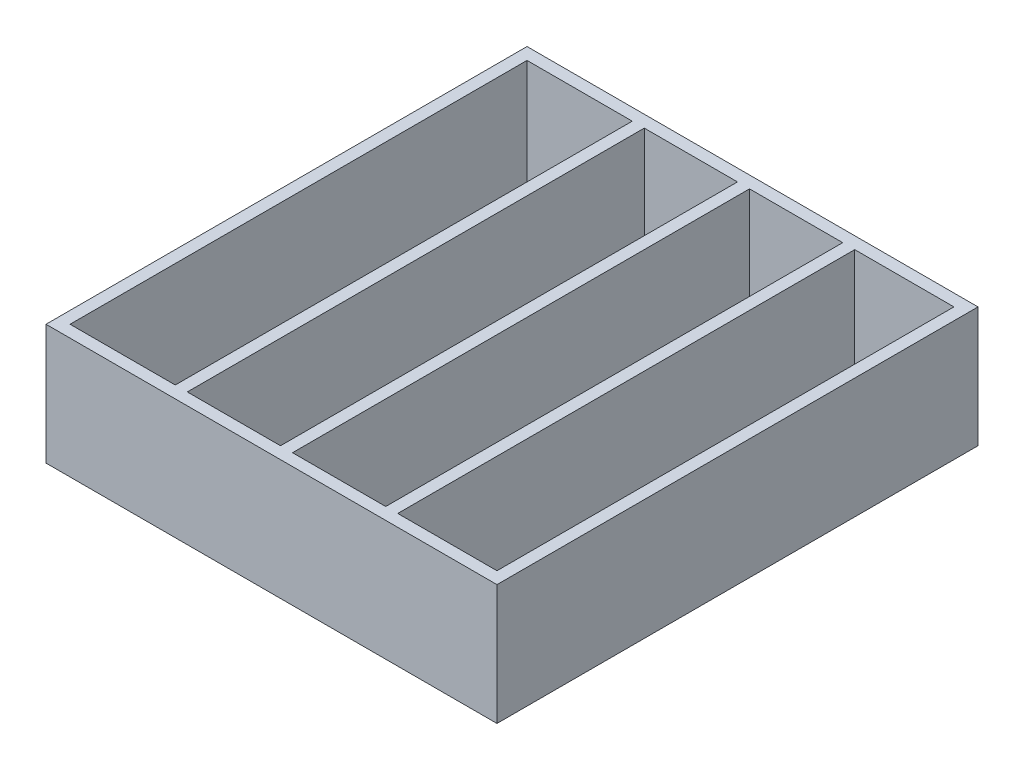
ISO-10303-21;
HEADER;
FILE_DESCRIPTION(('STEP AP214'),'2;1');
FILE_NAME('part.step','',(''),(''),'','','');
FILE_SCHEMA(('AUTOMOTIVE_DESIGN { 1 0 10303 214 1 1 1 1 }'));
ENDSEC;
DATA;
#1=APPLICATION_CONTEXT('core data for automotive mechanical design processes');
#2=APPLICATION_PROTOCOL_DEFINITION('international standard','automotive_design',2000,#1);
#3=PRODUCT_CONTEXT('',#1,'mechanical');
#4=PRODUCT('Part','Part','',(#3));
#5=PRODUCT_RELATED_PRODUCT_CATEGORY('part','',(#4));
#6=PRODUCT_DEFINITION_FORMATION('','',#4);
#7=PRODUCT_DEFINITION_CONTEXT('part definition',#1,'design');
#8=PRODUCT_DEFINITION('design','',#6,#7);
#9=PRODUCT_DEFINITION_SHAPE('','',#8);
#10=(LENGTH_UNIT() NAMED_UNIT(*) SI_UNIT(.MILLI.,.METRE.));
#11=(NAMED_UNIT(*) PLANE_ANGLE_UNIT() SI_UNIT($,.RADIAN.));
#12=(NAMED_UNIT(*) SI_UNIT($,.STERADIAN.) SOLID_ANGLE_UNIT());
#13=UNCERTAINTY_MEASURE_WITH_UNIT(LENGTH_MEASURE(1.E-05),#10,'distance_accuracy_value','');
#14=(GEOMETRIC_REPRESENTATION_CONTEXT(3) GLOBAL_UNCERTAINTY_ASSIGNED_CONTEXT((#13)) GLOBAL_UNIT_ASSIGNED_CONTEXT((#10,
#11,#12)) REPRESENTATION_CONTEXT('',''));
#15=CARTESIAN_POINT('',(0.,0.,0.));
#16=DIRECTION('',(0.,0.,1.));
#17=DIRECTION('',(1.,0.,0.));
#18=AXIS2_PLACEMENT_3D('',#15,#16,#17);
#19=CARTESIAN_POINT('',(0.,18.,0.));
#20=DIRECTION('',(0.,-1.,0.));
#21=DIRECTION('',(0.,0.,-1.));
#22=AXIS2_PLACEMENT_3D('',#19,#20,#21);
#23=PLANE('',#22);
#24=DIRECTION('',(-1.,0.,0.));
#25=VECTOR('',#24,1.);
#26=CARTESIAN_POINT('',(-16.,18.,-38.));
#27=LINE('',#26,#25);
#28=CARTESIAN_POINT('',(-0.500000000000007,18.,-38.));
#29=VERTEX_POINT('',#28);
#30=CARTESIAN_POINT('',(-16.,18.,-38.));
#31=VERTEX_POINT('',#30);
#32=EDGE_CURVE('E265',#29,#31,#27,.T.);
#33=ORIENTED_EDGE('',*,*,#32,.F.);
#34=DIRECTION('',(0.,0.,-1.));
#35=VECTOR('',#34,1.);
#36=CARTESIAN_POINT('',(-0.500000000000007,18.,-38.));
#37=LINE('',#36,#35);
#38=CARTESIAN_POINT('',(-0.499999999999997,18.,38.));
#39=VERTEX_POINT('',#38);
#40=EDGE_CURVE('E276',#39,#29,#37,.T.);
#41=ORIENTED_EDGE('',*,*,#40,.F.);
#42=DIRECTION('',(1.,0.,0.));
#43=VECTOR('',#42,1.);
#44=CARTESIAN_POINT('',(-16.,18.,38.));
#45=LINE('',#44,#43);
#46=CARTESIAN_POINT('',(-16.,18.,38.));
#47=VERTEX_POINT('',#46);
#48=EDGE_CURVE('E272',#47,#39,#45,.T.);
#49=ORIENTED_EDGE('',*,*,#48,.F.);
#50=DIRECTION('',(0.,0.,1.));
#51=VECTOR('',#50,1.);
#52=CARTESIAN_POINT('',(-16.,18.,-38.));
#53=LINE('',#52,#51);
#54=EDGE_CURVE('E268',#31,#47,#53,.T.);
#55=ORIENTED_EDGE('',*,*,#54,.F.);
#56=EDGE_LOOP('',(#33,#41,#49,#55));
#57=FACE_BOUND('',#56,.T.);
#58=DIRECTION('',(-1.,0.,0.));
#59=VECTOR('',#58,1.);
#60=CARTESIAN_POINT('',(19.,18.,-38.));
#61=LINE('',#60,#59);
#62=CARTESIAN_POINT('',(35.5,18.,-38.));
#63=VERTEX_POINT('',#62);
#64=CARTESIAN_POINT('',(19.,18.,-38.));
#65=VERTEX_POINT('',#64);
#66=EDGE_CURVE('E353',#63,#65,#61,.T.);
#67=ORIENTED_EDGE('',*,*,#66,.F.);
#68=DIRECTION('',(0.,0.,-1.));
#69=VECTOR('',#68,1.);
#70=CARTESIAN_POINT('',(35.5,18.,38.));
#71=LINE('',#70,#69);
#72=CARTESIAN_POINT('',(35.5,18.,38.));
#73=VERTEX_POINT('',#72);
#74=EDGE_CURVE('E364',#73,#63,#71,.T.);
#75=ORIENTED_EDGE('',*,*,#74,.F.);
#76=DIRECTION('',(1.,0.,0.));
#77=VECTOR('',#76,1.);
#78=CARTESIAN_POINT('',(19.,18.,38.));
#79=LINE('',#78,#77);
#80=CARTESIAN_POINT('',(19.,18.,38.));
#81=VERTEX_POINT('',#80);
#82=EDGE_CURVE('E360',#81,#73,#79,.T.);
#83=ORIENTED_EDGE('',*,*,#82,.F.);
#84=DIRECTION('',(0.,0.,1.));
#85=VECTOR('',#84,1.);
#86=CARTESIAN_POINT('',(19.,18.,-38.));
#87=LINE('',#86,#85);
#88=EDGE_CURVE('E356',#65,#81,#87,.T.);
#89=ORIENTED_EDGE('',*,*,#88,.F.);
#90=EDGE_LOOP('',(#67,#75,#83,#89));
#91=FACE_BOUND('',#90,.T.);
#92=DIRECTION('',(0.,0.,-1.));
#93=VECTOR('',#92,1.);
#94=CARTESIAN_POINT('',(37.5,18.,40.));
#95=LINE('',#94,#93);
#96=CARTESIAN_POINT('',(37.5,18.,40.));
#97=VERTEX_POINT('',#96);
#98=CARTESIAN_POINT('',(37.5,18.,-40.));
#99=VERTEX_POINT('',#98);
#100=EDGE_CURVE('E396',#97,#99,#95,.T.);
#101=ORIENTED_EDGE('',*,*,#100,.T.);
#102=DIRECTION('',(-1.,0.,0.));
#103=VECTOR('',#102,1.);
#104=CARTESIAN_POINT('',(-37.5,18.,-40.));
#105=LINE('',#104,#103);
#106=CARTESIAN_POINT('',(-37.5,18.,-40.));
#107=VERTEX_POINT('',#106);
#108=EDGE_CURVE('E400',#99,#107,#105,.T.);
#109=ORIENTED_EDGE('',*,*,#108,.T.);
#110=DIRECTION('',(0.,0.,1.));
#111=VECTOR('',#110,1.);
#112=CARTESIAN_POINT('',(-37.5,18.,40.));
#113=LINE('',#112,#111);
#114=CARTESIAN_POINT('',(-37.5,18.,40.));
#115=VERTEX_POINT('',#114);
#116=EDGE_CURVE('E196',#107,#115,#113,.T.);
#117=ORIENTED_EDGE('',*,*,#116,.T.);
#118=DIRECTION('',(1.,0.,0.));
#119=VECTOR('',#118,1.);
#120=CARTESIAN_POINT('',(-37.5,18.,40.));
#121=LINE('',#120,#119);
#122=EDGE_CURVE('E405',#115,#97,#121,.T.);
#123=ORIENTED_EDGE('',*,*,#122,.T.);
#124=EDGE_LOOP('',(#101,#109,#117,#123));
#125=FACE_BOUND('',#124,.T.);
#126=DIRECTION('',(0.,0.,1.));
#127=VECTOR('',#126,1.);
#128=CARTESIAN_POINT('',(-35.5,18.,38.));
#129=LINE('',#128,#127);
#130=CARTESIAN_POINT('',(-35.5,18.,-38.));
#131=VERTEX_POINT('',#130);
#132=CARTESIAN_POINT('',(-35.5,18.,38.));
#133=VERTEX_POINT('',#132);
#134=EDGE_CURVE('E309',#131,#133,#129,.T.);
#135=ORIENTED_EDGE('',*,*,#134,.F.);
#136=DIRECTION('',(-1.,0.,0.));
#137=VECTOR('',#136,1.);
#138=CARTESIAN_POINT('',(-35.5,18.,-38.));
#139=LINE('',#138,#137);
#140=CARTESIAN_POINT('',(-18.,18.,-38.));
#141=VERTEX_POINT('',#140);
#142=EDGE_CURVE('E320',#141,#131,#139,.T.);
#143=ORIENTED_EDGE('',*,*,#142,.F.);
#144=DIRECTION('',(0.,0.,-1.));
#145=VECTOR('',#144,1.);
#146=CARTESIAN_POINT('',(-18.,18.,-38.));
#147=LINE('',#146,#145);
#148=CARTESIAN_POINT('',(-18.,18.,38.));
#149=VERTEX_POINT('',#148);
#150=EDGE_CURVE('E316',#149,#141,#147,.T.);
#151=ORIENTED_EDGE('',*,*,#150,.F.);
#152=DIRECTION('',(1.,0.,0.));
#153=VECTOR('',#152,1.);
#154=CARTESIAN_POINT('',(-35.5,18.,38.));
#155=LINE('',#154,#153);
#156=EDGE_CURVE('E312',#133,#149,#155,.T.);
#157=ORIENTED_EDGE('',*,*,#156,.F.);
#158=EDGE_LOOP('',(#135,#143,#151,#157));
#159=FACE_BOUND('',#158,.T.);
#160=DIRECTION('',(-1.,0.,0.));
#161=VECTOR('',#160,1.);
#162=CARTESIAN_POINT('',(1.49999999999999,18.,-38.));
#163=LINE('',#162,#161);
#164=CARTESIAN_POINT('',(17.,18.,-38.));
#165=VERTEX_POINT('',#164);
#166=CARTESIAN_POINT('',(1.49999999999999,18.,-38.));
#167=VERTEX_POINT('',#166);
#168=EDGE_CURVE('E227',#165,#167,#163,.T.);
#169=ORIENTED_EDGE('',*,*,#168,.F.);
#170=DIRECTION('',(0.,0.,-1.));
#171=VECTOR('',#170,1.);
#172=CARTESIAN_POINT('',(17.,18.,-38.));
#173=LINE('',#172,#171);
#174=CARTESIAN_POINT('',(17.,18.,38.));
#175=VERTEX_POINT('',#174);
#176=EDGE_CURVE('E237',#175,#165,#173,.T.);
#177=ORIENTED_EDGE('',*,*,#176,.F.);
#178=DIRECTION('',(1.,0.,0.));
#179=VECTOR('',#178,1.);
#180=CARTESIAN_POINT('',(1.5,18.,38.));
#181=LINE('',#180,#179);
#182=CARTESIAN_POINT('',(1.5,18.,38.));
#183=VERTEX_POINT('',#182);
#184=EDGE_CURVE('E234',#183,#175,#181,.T.);
#185=ORIENTED_EDGE('',*,*,#184,.F.);
#186=DIRECTION('',(0.,0.,1.));
#187=VECTOR('',#186,1.);
#188=CARTESIAN_POINT('',(1.49999999999999,18.,-38.));
#189=LINE('',#188,#187);
#190=EDGE_CURVE('E230',#167,#183,#189,.T.);
#191=ORIENTED_EDGE('',*,*,#190,.F.);
#192=EDGE_LOOP('',(#169,#177,#185,#191));
#193=FACE_BOUND('',#192,.T.);
#194=ADVANCED_FACE('F51',(#57,#91,#125,#159,#193),#23,.F.);
#195=CARTESIAN_POINT('',(37.5,18.,40.));
#196=DIRECTION('',(-1.,0.,0.));
#197=DIRECTION('',(0.,0.,1.));
#198=AXIS2_PLACEMENT_3D('',#195,#196,#197);
#199=PLANE('',#198);
#200=DIRECTION('',(0.,-1.,0.));
#201=VECTOR('',#200,1.);
#202=CARTESIAN_POINT('',(37.5,18.,40.));
#203=LINE('',#202,#201);
#204=CARTESIAN_POINT('',(37.5,-2.,40.));
#205=VERTEX_POINT('',#204);
#206=EDGE_CURVE('E408',#97,#205,#203,.T.);
#207=ORIENTED_EDGE('',*,*,#206,.T.);
#208=DIRECTION('',(0.,0.,1.));
#209=VECTOR('',#208,1.);
#210=CARTESIAN_POINT('',(37.5,-2.,-40.));
#211=LINE('',#210,#209);
#212=CARTESIAN_POINT('',(37.5,-2.,-40.));
#213=VERTEX_POINT('',#212);
#214=EDGE_CURVE('E208',#213,#205,#211,.T.);
#215=ORIENTED_EDGE('',*,*,#214,.F.);
#216=DIRECTION('',(0.,-1.,0.));
#217=VECTOR('',#216,1.);
#218=CARTESIAN_POINT('',(37.5,18.,-40.));
#219=LINE('',#218,#217);
#220=EDGE_CURVE('E12',#99,#213,#219,.T.);
#221=ORIENTED_EDGE('',*,*,#220,.F.);
#222=ORIENTED_EDGE('',*,*,#100,.F.);
#223=EDGE_LOOP('',(#207,#215,#221,#222));
#224=FACE_BOUND('',#223,.T.);
#225=ADVANCED_FACE('F53',(#224),#199,.F.);
#226=CARTESIAN_POINT('',(-37.5,18.,-40.));
#227=DIRECTION('',(0.,0.,1.));
#228=DIRECTION('',(1.,0.,0.));
#229=AXIS2_PLACEMENT_3D('',#226,#227,#228);
#230=PLANE('',#229);
#231=ORIENTED_EDGE('',*,*,#220,.T.);
#232=DIRECTION('',(1.,0.,0.));
#233=VECTOR('',#232,1.);
#234=CARTESIAN_POINT('',(37.5,-2.,-40.));
#235=LINE('',#234,#233);
#236=CARTESIAN_POINT('',(-37.5,-2.,-40.));
#237=VERTEX_POINT('',#236);
#238=EDGE_CURVE('E201',#237,#213,#235,.T.);
#239=ORIENTED_EDGE('',*,*,#238,.F.);
#240=DIRECTION('',(0.,-1.,0.));
#241=VECTOR('',#240,1.);
#242=CARTESIAN_POINT('',(-37.5,18.,-40.));
#243=LINE('',#242,#241);
#244=EDGE_CURVE('E60',#107,#237,#243,.T.);
#245=ORIENTED_EDGE('',*,*,#244,.F.);
#246=ORIENTED_EDGE('',*,*,#108,.F.);
#247=EDGE_LOOP('',(#231,#239,#245,#246));
#248=FACE_BOUND('',#247,.T.);
#249=ADVANCED_FACE('F202',(#248),#230,.F.);
#250=CARTESIAN_POINT('',(-37.5,18.,40.));
#251=DIRECTION('',(1.,0.,0.));
#252=DIRECTION('',(0.,0.,-1.));
#253=AXIS2_PLACEMENT_3D('',#250,#251,#252);
#254=PLANE('',#253);
#255=ORIENTED_EDGE('',*,*,#244,.T.);
#256=DIRECTION('',(0.,0.,-1.));
#257=VECTOR('',#256,1.);
#258=CARTESIAN_POINT('',(-37.5,-2.,-40.));
#259=LINE('',#258,#257);
#260=CARTESIAN_POINT('',(-37.5,-2.,40.));
#261=VERTEX_POINT('',#260);
#262=EDGE_CURVE('E195',#261,#237,#259,.T.);
#263=ORIENTED_EDGE('',*,*,#262,.F.);
#264=DIRECTION('',(0.,-1.,0.));
#265=VECTOR('',#264,1.);
#266=CARTESIAN_POINT('',(-37.5,18.,40.));
#267=LINE('',#266,#265);
#268=EDGE_CURVE('E199',#115,#261,#267,.T.);
#269=ORIENTED_EDGE('',*,*,#268,.F.);
#270=ORIENTED_EDGE('',*,*,#116,.F.);
#271=EDGE_LOOP('',(#255,#263,#269,#270));
#272=FACE_BOUND('',#271,.T.);
#273=ADVANCED_FACE('F192',(#272),#254,.F.);
#274=CARTESIAN_POINT('',(-37.5,18.,40.));
#275=DIRECTION('',(0.,0.,-1.));
#276=DIRECTION('',(-1.,0.,0.));
#277=AXIS2_PLACEMENT_3D('',#274,#275,#276);
#278=PLANE('',#277);
#279=ORIENTED_EDGE('',*,*,#268,.T.);
#280=DIRECTION('',(-1.,0.,0.));
#281=VECTOR('',#280,1.);
#282=CARTESIAN_POINT('',(37.5,-2.,40.));
#283=LINE('',#282,#281);
#284=EDGE_CURVE('E213',#205,#261,#283,.T.);
#285=ORIENTED_EDGE('',*,*,#284,.F.);
#286=ORIENTED_EDGE('',*,*,#206,.F.);
#287=ORIENTED_EDGE('',*,*,#122,.F.);
#288=EDGE_LOOP('',(#279,#285,#286,#287));
#289=FACE_BOUND('',#288,.T.);
#290=ADVANCED_FACE('F414',(#289),#278,.F.);
#291=CARTESIAN_POINT('',(19.,18.,-38.));
#292=DIRECTION('',(0.,0.,1.));
#293=DIRECTION('',(1.,0.,0.));
#294=AXIS2_PLACEMENT_3D('',#291,#292,#293);
#295=PLANE('',#294);
#296=DIRECTION('',(-1.,0.,0.));
#297=VECTOR('',#296,1.);
#298=CARTESIAN_POINT('',(19.,0.,-38.));
#299=LINE('',#298,#297);
#300=CARTESIAN_POINT('',(35.5,0.,-38.));
#301=VERTEX_POINT('',#300);
#302=CARTESIAN_POINT('',(19.,0.,-38.));
#303=VERTEX_POINT('',#302);
#304=EDGE_CURVE('E352',#301,#303,#299,.T.);
#305=ORIENTED_EDGE('',*,*,#304,.F.);
#306=DIRECTION('',(0.,-1.,0.));
#307=VECTOR('',#306,1.);
#308=CARTESIAN_POINT('',(35.5,18.,-38.));
#309=LINE('',#308,#307);
#310=EDGE_CURVE('E367',#63,#301,#309,.T.);
#311=ORIENTED_EDGE('',*,*,#310,.F.);
#312=ORIENTED_EDGE('',*,*,#66,.T.);
#313=DIRECTION('',(0.,-1.,0.));
#314=VECTOR('',#313,1.);
#315=CARTESIAN_POINT('',(19.,18.,-38.));
#316=LINE('',#315,#314);
#317=EDGE_CURVE('E392',#65,#303,#316,.T.);
#318=ORIENTED_EDGE('',*,*,#317,.T.);
#319=EDGE_LOOP('',(#305,#311,#312,#318));
#320=FACE_BOUND('',#319,.T.);
#321=ADVANCED_FACE('F433',(#320),#295,.T.);
#322=CARTESIAN_POINT('',(19.,18.,-38.));
#323=DIRECTION('',(1.,0.,0.));
#324=DIRECTION('',(0.,0.,-1.));
#325=AXIS2_PLACEMENT_3D('',#322,#323,#324);
#326=PLANE('',#325);
#327=DIRECTION('',(0.,0.,1.));
#328=VECTOR('',#327,1.);
#329=CARTESIAN_POINT('',(19.,0.,-38.));
#330=LINE('',#329,#328);
#331=CARTESIAN_POINT('',(19.,0.,38.));
#332=VERTEX_POINT('',#331);
#333=EDGE_CURVE('E371',#303,#332,#330,.T.);
#334=ORIENTED_EDGE('',*,*,#333,.F.);
#335=ORIENTED_EDGE('',*,*,#317,.F.);
#336=ORIENTED_EDGE('',*,*,#88,.T.);
#337=DIRECTION('',(0.,-1.,0.));
#338=VECTOR('',#337,1.);
#339=CARTESIAN_POINT('',(19.,18.,38.));
#340=LINE('',#339,#338);
#341=EDGE_CURVE('E389',#81,#332,#340,.T.);
#342=ORIENTED_EDGE('',*,*,#341,.T.);
#343=EDGE_LOOP('',(#334,#335,#336,#342));
#344=FACE_BOUND('',#343,.T.);
#345=ADVANCED_FACE('F452',(#344),#326,.T.);
#346=CARTESIAN_POINT('',(19.,18.,38.));
#347=DIRECTION('',(0.,0.,-1.));
#348=DIRECTION('',(-1.,0.,0.));
#349=AXIS2_PLACEMENT_3D('',#346,#347,#348);
#350=PLANE('',#349);
#351=DIRECTION('',(1.,0.,0.));
#352=VECTOR('',#351,1.);
#353=CARTESIAN_POINT('',(19.,0.,38.));
#354=LINE('',#353,#352);
#355=CARTESIAN_POINT('',(35.5,0.,38.));
#356=VERTEX_POINT('',#355);
#357=EDGE_CURVE('E375',#332,#356,#354,.T.);
#358=ORIENTED_EDGE('',*,*,#357,.F.);
#359=ORIENTED_EDGE('',*,*,#341,.F.);
#360=ORIENTED_EDGE('',*,*,#82,.T.);
#361=DIRECTION('',(0.,-1.,0.));
#362=VECTOR('',#361,1.);
#363=CARTESIAN_POINT('',(35.5,18.,38.));
#364=LINE('',#363,#362);
#365=EDGE_CURVE('E385',#73,#356,#364,.T.);
#366=ORIENTED_EDGE('',*,*,#365,.T.);
#367=EDGE_LOOP('',(#358,#359,#360,#366));
#368=FACE_BOUND('',#367,.T.);
#369=ADVANCED_FACE('F459',(#368),#350,.T.);
#370=CARTESIAN_POINT('',(35.5,18.,38.));
#371=DIRECTION('',(-1.,0.,0.));
#372=DIRECTION('',(0.,0.,1.));
#373=AXIS2_PLACEMENT_3D('',#370,#371,#372);
#374=PLANE('',#373);
#375=DIRECTION('',(0.,0.,-1.));
#376=VECTOR('',#375,1.);
#377=CARTESIAN_POINT('',(35.5,0.,38.));
#378=LINE('',#377,#376);
#379=EDGE_CURVE('E357',#356,#301,#378,.T.);
#380=ORIENTED_EDGE('',*,*,#379,.F.);
#381=ORIENTED_EDGE('',*,*,#365,.F.);
#382=ORIENTED_EDGE('',*,*,#74,.T.);
#383=ORIENTED_EDGE('',*,*,#310,.T.);
#384=EDGE_LOOP('',(#380,#381,#382,#383));
#385=FACE_BOUND('',#384,.T.);
#386=ADVANCED_FACE('F466',(#385),#374,.T.);
#387=CARTESIAN_POINT('',(-35.5,18.,38.));
#388=DIRECTION('',(1.,0.,0.));
#389=DIRECTION('',(0.,0.,-1.));
#390=AXIS2_PLACEMENT_3D('',#387,#388,#389);
#391=PLANE('',#390);
#392=DIRECTION('',(0.,0.,1.));
#393=VECTOR('',#392,1.);
#394=CARTESIAN_POINT('',(-35.5,0.,38.));
#395=LINE('',#394,#393);
#396=CARTESIAN_POINT('',(-35.5,0.,-38.));
#397=VERTEX_POINT('',#396);
#398=CARTESIAN_POINT('',(-35.5,0.,38.));
#399=VERTEX_POINT('',#398);
#400=EDGE_CURVE('E308',#397,#399,#395,.T.);
#401=ORIENTED_EDGE('',*,*,#400,.F.);
#402=DIRECTION('',(0.,-1.,0.));
#403=VECTOR('',#402,1.);
#404=CARTESIAN_POINT('',(-35.5,18.,-38.));
#405=LINE('',#404,#403);
#406=EDGE_CURVE('E323',#131,#397,#405,.T.);
#407=ORIENTED_EDGE('',*,*,#406,.F.);
#408=ORIENTED_EDGE('',*,*,#134,.T.);
#409=DIRECTION('',(0.,-1.,0.));
#410=VECTOR('',#409,1.);
#411=CARTESIAN_POINT('',(-35.5,18.,38.));
#412=LINE('',#411,#410);
#413=EDGE_CURVE('E348',#133,#399,#412,.T.);
#414=ORIENTED_EDGE('',*,*,#413,.T.);
#415=EDGE_LOOP('',(#401,#407,#408,#414));
#416=FACE_BOUND('',#415,.T.);
#417=ADVANCED_FACE('F474',(#416),#391,.T.);
#418=CARTESIAN_POINT('',(-35.5,18.,38.));
#419=DIRECTION('',(0.,0.,-1.));
#420=DIRECTION('',(-1.,0.,0.));
#421=AXIS2_PLACEMENT_3D('',#418,#419,#420);
#422=PLANE('',#421);
#423=DIRECTION('',(1.,0.,0.));
#424=VECTOR('',#423,1.);
#425=CARTESIAN_POINT('',(-35.5,0.,38.));
#426=LINE('',#425,#424);
#427=CARTESIAN_POINT('',(-18.,0.,38.));
#428=VERTEX_POINT('',#427);
#429=EDGE_CURVE('E327',#399,#428,#426,.T.);
#430=ORIENTED_EDGE('',*,*,#429,.F.);
#431=ORIENTED_EDGE('',*,*,#413,.F.);
#432=ORIENTED_EDGE('',*,*,#156,.T.);
#433=DIRECTION('',(0.,-1.,0.));
#434=VECTOR('',#433,1.);
#435=CARTESIAN_POINT('',(-18.,18.,38.));
#436=LINE('',#435,#434);
#437=EDGE_CURVE('E345',#149,#428,#436,.T.);
#438=ORIENTED_EDGE('',*,*,#437,.T.);
#439=EDGE_LOOP('',(#430,#431,#432,#438));
#440=FACE_BOUND('',#439,.T.);
#441=ADVANCED_FACE('F482',(#440),#422,.T.);
#442=CARTESIAN_POINT('',(-18.,18.,-38.));
#443=DIRECTION('',(-1.,0.,0.));
#444=DIRECTION('',(0.,0.,1.));
#445=AXIS2_PLACEMENT_3D('',#442,#443,#444);
#446=PLANE('',#445);
#447=DIRECTION('',(0.,0.,-1.));
#448=VECTOR('',#447,1.);
#449=CARTESIAN_POINT('',(-18.,0.,-38.));
#450=LINE('',#449,#448);
#451=CARTESIAN_POINT('',(-18.,0.,-38.));
#452=VERTEX_POINT('',#451);
#453=EDGE_CURVE('E331',#428,#452,#450,.T.);
#454=ORIENTED_EDGE('',*,*,#453,.F.);
#455=ORIENTED_EDGE('',*,*,#437,.F.);
#456=ORIENTED_EDGE('',*,*,#150,.T.);
#457=DIRECTION('',(0.,-1.,0.));
#458=VECTOR('',#457,1.);
#459=CARTESIAN_POINT('',(-18.,18.,-38.));
#460=LINE('',#459,#458);
#461=EDGE_CURVE('E341',#141,#452,#460,.T.);
#462=ORIENTED_EDGE('',*,*,#461,.T.);
#463=EDGE_LOOP('',(#454,#455,#456,#462));
#464=FACE_BOUND('',#463,.T.);
#465=ADVANCED_FACE('F490',(#464),#446,.T.);
#466=CARTESIAN_POINT('',(-35.5,18.,-38.));
#467=DIRECTION('',(0.,0.,1.));
#468=DIRECTION('',(1.,0.,0.));
#469=AXIS2_PLACEMENT_3D('',#466,#467,#468);
#470=PLANE('',#469);
#471=DIRECTION('',(-1.,0.,0.));
#472=VECTOR('',#471,1.);
#473=CARTESIAN_POINT('',(-35.5,0.,-38.));
#474=LINE('',#473,#472);
#475=EDGE_CURVE('E313',#452,#397,#474,.T.);
#476=ORIENTED_EDGE('',*,*,#475,.F.);
#477=ORIENTED_EDGE('',*,*,#461,.F.);
#478=ORIENTED_EDGE('',*,*,#142,.T.);
#479=ORIENTED_EDGE('',*,*,#406,.T.);
#480=EDGE_LOOP('',(#476,#477,#478,#479));
#481=FACE_BOUND('',#480,.T.);
#482=ADVANCED_FACE('F498',(#481),#470,.T.);
#483=CARTESIAN_POINT('',(-16.,18.,-38.));
#484=DIRECTION('',(0.,0.,1.));
#485=DIRECTION('',(1.,0.,0.));
#486=AXIS2_PLACEMENT_3D('',#483,#484,#485);
#487=PLANE('',#486);
#488=DIRECTION('',(-1.,0.,0.));
#489=VECTOR('',#488,1.);
#490=CARTESIAN_POINT('',(-16.,0.,-38.));
#491=LINE('',#490,#489);
#492=CARTESIAN_POINT('',(-0.500000000000007,0.,-38.));
#493=VERTEX_POINT('',#492);
#494=CARTESIAN_POINT('',(-16.,0.,-38.));
#495=VERTEX_POINT('',#494);
#496=EDGE_CURVE('E264',#493,#495,#491,.T.);
#497=ORIENTED_EDGE('',*,*,#496,.F.);
#498=DIRECTION('',(0.,-1.,0.));
#499=VECTOR('',#498,1.);
#500=CARTESIAN_POINT('',(-0.500000000000007,18.,-38.));
#501=LINE('',#500,#499);
#502=EDGE_CURVE('E279',#29,#493,#501,.T.);
#503=ORIENTED_EDGE('',*,*,#502,.F.);
#504=ORIENTED_EDGE('',*,*,#32,.T.);
#505=DIRECTION('',(0.,-1.,0.));
#506=VECTOR('',#505,1.);
#507=CARTESIAN_POINT('',(-16.,18.,-38.));
#508=LINE('',#507,#506);
#509=EDGE_CURVE('E304',#31,#495,#508,.T.);
#510=ORIENTED_EDGE('',*,*,#509,.T.);
#511=EDGE_LOOP('',(#497,#503,#504,#510));
#512=FACE_BOUND('',#511,.T.);
#513=ADVANCED_FACE('F506',(#512),#487,.T.);
#514=CARTESIAN_POINT('',(-16.,18.,-38.));
#515=DIRECTION('',(1.,0.,0.));
#516=DIRECTION('',(0.,0.,-1.));
#517=AXIS2_PLACEMENT_3D('',#514,#515,#516);
#518=PLANE('',#517);
#519=DIRECTION('',(0.,0.,1.));
#520=VECTOR('',#519,1.);
#521=CARTESIAN_POINT('',(-16.,0.,-38.));
#522=LINE('',#521,#520);
#523=CARTESIAN_POINT('',(-16.,0.,38.));
#524=VERTEX_POINT('',#523);
#525=EDGE_CURVE('E283',#495,#524,#522,.T.);
#526=ORIENTED_EDGE('',*,*,#525,.F.);
#527=ORIENTED_EDGE('',*,*,#509,.F.);
#528=ORIENTED_EDGE('',*,*,#54,.T.);
#529=DIRECTION('',(0.,-1.,0.));
#530=VECTOR('',#529,1.);
#531=CARTESIAN_POINT('',(-16.,18.,38.));
#532=LINE('',#531,#530);
#533=EDGE_CURVE('E301',#47,#524,#532,.T.);
#534=ORIENTED_EDGE('',*,*,#533,.T.);
#535=EDGE_LOOP('',(#526,#527,#528,#534));
#536=FACE_BOUND('',#535,.T.);
#537=ADVANCED_FACE('F514',(#536),#518,.T.);
#538=CARTESIAN_POINT('',(-16.,18.,38.));
#539=DIRECTION('',(0.,0.,-1.));
#540=DIRECTION('',(-1.,0.,0.));
#541=AXIS2_PLACEMENT_3D('',#538,#539,#540);
#542=PLANE('',#541);
#543=DIRECTION('',(1.,0.,0.));
#544=VECTOR('',#543,1.);
#545=CARTESIAN_POINT('',(-16.,0.,38.));
#546=LINE('',#545,#544);
#547=CARTESIAN_POINT('',(-0.499999999999997,0.,38.));
#548=VERTEX_POINT('',#547);
#549=EDGE_CURVE('E287',#524,#548,#546,.T.);
#550=ORIENTED_EDGE('',*,*,#549,.F.);
#551=ORIENTED_EDGE('',*,*,#533,.F.);
#552=ORIENTED_EDGE('',*,*,#48,.T.);
#553=DIRECTION('',(0.,-1.,0.));
#554=VECTOR('',#553,1.);
#555=CARTESIAN_POINT('',(-0.499999999999997,18.,38.));
#556=LINE('',#555,#554);
#557=EDGE_CURVE('E297',#39,#548,#556,.T.);
#558=ORIENTED_EDGE('',*,*,#557,.T.);
#559=EDGE_LOOP('',(#550,#551,#552,#558));
#560=FACE_BOUND('',#559,.T.);
#561=ADVANCED_FACE('F522',(#560),#542,.T.);
#562=CARTESIAN_POINT('',(-0.500000000000007,18.,-38.));
#563=DIRECTION('',(-1.,0.,0.));
#564=DIRECTION('',(0.,0.,1.));
#565=AXIS2_PLACEMENT_3D('',#562,#563,#564);
#566=PLANE('',#565);
#567=DIRECTION('',(0.,0.,-1.));
#568=VECTOR('',#567,1.);
#569=CARTESIAN_POINT('',(-0.500000000000007,0.,-38.));
#570=LINE('',#569,#568);
#571=EDGE_CURVE('E269',#548,#493,#570,.T.);
#572=ORIENTED_EDGE('',*,*,#571,.F.);
#573=ORIENTED_EDGE('',*,*,#557,.F.);
#574=ORIENTED_EDGE('',*,*,#40,.T.);
#575=ORIENTED_EDGE('',*,*,#502,.T.);
#576=EDGE_LOOP('',(#572,#573,#574,#575));
#577=FACE_BOUND('',#576,.T.);
#578=ADVANCED_FACE('F530',(#577),#566,.T.);
#579=CARTESIAN_POINT('',(1.49999999999999,18.,-38.));
#580=DIRECTION('',(0.,0.,1.));
#581=DIRECTION('',(1.,0.,0.));
#582=AXIS2_PLACEMENT_3D('',#579,#580,#581);
#583=PLANE('',#582);
#584=DIRECTION('',(-1.,0.,0.));
#585=VECTOR('',#584,1.);
#586=CARTESIAN_POINT('',(1.49999999999999,0.,-38.));
#587=LINE('',#586,#585);
#588=CARTESIAN_POINT('',(17.,0.,-38.));
#589=VERTEX_POINT('',#588);
#590=CARTESIAN_POINT('',(1.49999999999999,0.,-38.));
#591=VERTEX_POINT('',#590);
#592=EDGE_CURVE('E75',#589,#591,#587,.T.);
#593=ORIENTED_EDGE('',*,*,#592,.F.);
#594=DIRECTION('',(0.,-1.,0.));
#595=VECTOR('',#594,1.);
#596=CARTESIAN_POINT('',(17.,18.,-38.));
#597=LINE('',#596,#595);
#598=EDGE_CURVE('E240',#165,#589,#597,.T.);
#599=ORIENTED_EDGE('',*,*,#598,.F.);
#600=ORIENTED_EDGE('',*,*,#168,.T.);
#601=DIRECTION('',(0.,-1.,0.));
#602=VECTOR('',#601,1.);
#603=CARTESIAN_POINT('',(1.49999999999999,18.,-38.));
#604=LINE('',#603,#602);
#605=EDGE_CURVE('E261',#167,#591,#604,.T.);
#606=ORIENTED_EDGE('',*,*,#605,.T.);
#607=EDGE_LOOP('',(#593,#599,#600,#606));
#608=FACE_BOUND('',#607,.T.);
#609=ADVANCED_FACE('F538',(#608),#583,.T.);
#610=CARTESIAN_POINT('',(1.49999999999999,18.,-38.));
#611=DIRECTION('',(1.,0.,0.));
#612=DIRECTION('',(0.,0.,-1.));
#613=AXIS2_PLACEMENT_3D('',#610,#611,#612);
#614=PLANE('',#613);
#615=DIRECTION('',(0.,0.,1.));
#616=VECTOR('',#615,1.);
#617=CARTESIAN_POINT('',(1.49999999999999,0.,-38.));
#618=LINE('',#617,#616);
#619=CARTESIAN_POINT('',(1.5,0.,38.));
#620=VERTEX_POINT('',#619);
#621=EDGE_CURVE('E243',#591,#620,#618,.T.);
#622=ORIENTED_EDGE('',*,*,#621,.F.);
#623=ORIENTED_EDGE('',*,*,#605,.F.);
#624=ORIENTED_EDGE('',*,*,#190,.T.);
#625=DIRECTION('',(0.,-1.,0.));
#626=VECTOR('',#625,1.);
#627=CARTESIAN_POINT('',(1.5,18.,38.));
#628=LINE('',#627,#626);
#629=EDGE_CURVE('E258',#183,#620,#628,.T.);
#630=ORIENTED_EDGE('',*,*,#629,.T.);
#631=EDGE_LOOP('',(#622,#623,#624,#630));
#632=FACE_BOUND('',#631,.T.);
#633=ADVANCED_FACE('F546',(#632),#614,.T.);
#634=CARTESIAN_POINT('',(1.5,18.,38.));
#635=DIRECTION('',(0.,0.,-1.));
#636=DIRECTION('',(-1.,0.,0.));
#637=AXIS2_PLACEMENT_3D('',#634,#635,#636);
#638=PLANE('',#637);
#639=DIRECTION('',(1.,0.,0.));
#640=VECTOR('',#639,1.);
#641=CARTESIAN_POINT('',(1.5,0.,38.));
#642=LINE('',#641,#640);
#643=CARTESIAN_POINT('',(17.,0.,38.));
#644=VERTEX_POINT('',#643);
#645=EDGE_CURVE('E247',#620,#644,#642,.T.);
#646=ORIENTED_EDGE('',*,*,#645,.F.);
#647=ORIENTED_EDGE('',*,*,#629,.F.);
#648=ORIENTED_EDGE('',*,*,#184,.T.);
#649=DIRECTION('',(0.,-1.,0.));
#650=VECTOR('',#649,1.);
#651=CARTESIAN_POINT('',(17.,18.,38.));
#652=LINE('',#651,#650);
#653=EDGE_CURVE('E67',#175,#644,#652,.T.);
#654=ORIENTED_EDGE('',*,*,#653,.T.);
#655=EDGE_LOOP('',(#646,#647,#648,#654));
#656=FACE_BOUND('',#655,.T.);
#657=ADVANCED_FACE('F553',(#656),#638,.T.);
#658=CARTESIAN_POINT('',(17.,18.,-38.));
#659=DIRECTION('',(-1.,0.,0.));
#660=DIRECTION('',(0.,0.,1.));
#661=AXIS2_PLACEMENT_3D('',#658,#659,#660);
#662=PLANE('',#661);
#663=DIRECTION('',(0.,0.,-1.));
#664=VECTOR('',#663,1.);
#665=CARTESIAN_POINT('',(17.,0.,-38.));
#666=LINE('',#665,#664);
#667=EDGE_CURVE('E231',#644,#589,#666,.T.);
#668=ORIENTED_EDGE('',*,*,#667,.F.);
#669=ORIENTED_EDGE('',*,*,#653,.F.);
#670=ORIENTED_EDGE('',*,*,#176,.T.);
#671=ORIENTED_EDGE('',*,*,#598,.T.);
#672=EDGE_LOOP('',(#668,#669,#670,#671));
#673=FACE_BOUND('',#672,.T.);
#674=ADVANCED_FACE('F561',(#673),#662,.T.);
#675=CARTESIAN_POINT('',(0.,0.,0.));
#676=DIRECTION('',(0.,-1.,0.));
#677=DIRECTION('',(0.,0.,-1.));
#678=AXIS2_PLACEMENT_3D('',#675,#676,#677);
#679=PLANE('',#678);
#680=ORIENTED_EDGE('',*,*,#645,.T.);
#681=ORIENTED_EDGE('',*,*,#667,.T.);
#682=ORIENTED_EDGE('',*,*,#592,.T.);
#683=ORIENTED_EDGE('',*,*,#621,.T.);
#684=EDGE_LOOP('',(#680,#681,#682,#683));
#685=FACE_BOUND('',#684,.T.);
#686=ADVANCED_FACE('F569',(#685),#679,.F.);
#687=ORIENTED_EDGE('',*,*,#549,.T.);
#688=ORIENTED_EDGE('',*,*,#571,.T.);
#689=ORIENTED_EDGE('',*,*,#496,.T.);
#690=ORIENTED_EDGE('',*,*,#525,.T.);
#691=EDGE_LOOP('',(#687,#688,#689,#690));
#692=FACE_BOUND('',#691,.T.);
#693=ADVANCED_FACE('F576',(#692),#679,.F.);
#694=CARTESIAN_POINT('',(-26.75,0.,0.500000000000014));
#695=DIRECTION('',(0.,1.,0.));
#696=DIRECTION('',(0.,0.,1.));
#697=AXIS2_PLACEMENT_3D('',#694,#695,#696);
#698=CIRCLE('',#697,1.5);
#699=CARTESIAN_POINT('',(-26.75,0.,2.00000000000001));
#700=VERTEX_POINT('',#699);
#701=EDGE_CURVE('E219',#700,#700,#698,.T.);
#702=ORIENTED_EDGE('',*,*,#701,.F.);
#703=EDGE_LOOP('',(#702));
#704=FACE_BOUND('',#703,.T.);
#705=ORIENTED_EDGE('',*,*,#453,.T.);
#706=ORIENTED_EDGE('',*,*,#475,.T.);
#707=ORIENTED_EDGE('',*,*,#400,.T.);
#708=ORIENTED_EDGE('',*,*,#429,.T.);
#709=EDGE_LOOP('',(#705,#706,#707,#708));
#710=FACE_BOUND('',#709,.T.);
#711=ADVANCED_FACE('F585',(#704,#710),#679,.F.);
#712=CARTESIAN_POINT('',(26.75,0.,0.500000000000014));
#713=DIRECTION('',(0.,-1.,0.));
#714=DIRECTION('',(0.,0.,1.));
#715=AXIS2_PLACEMENT_3D('',#712,#713,#714);
#716=CIRCLE('',#715,1.5);
#717=CARTESIAN_POINT('',(26.75,0.,2.00000000000001));
#718=VERTEX_POINT('',#717);
#719=EDGE_CURVE('E642',#718,#718,#716,.T.);
#720=ORIENTED_EDGE('',*,*,#719,.T.);
#721=EDGE_LOOP('',(#720));
#722=FACE_BOUND('',#721,.T.);
#723=ORIENTED_EDGE('',*,*,#357,.T.);
#724=ORIENTED_EDGE('',*,*,#379,.T.);
#725=ORIENTED_EDGE('',*,*,#304,.T.);
#726=ORIENTED_EDGE('',*,*,#333,.T.);
#727=EDGE_LOOP('',(#723,#724,#725,#726));
#728=FACE_BOUND('',#727,.T.);
#729=ADVANCED_FACE('F579',(#722,#728),#679,.F.);
#730=CARTESIAN_POINT('',(0.,-2.,0.));
#731=DIRECTION('',(0.,-1.,0.));
#732=DIRECTION('',(0.,0.,-1.));
#733=AXIS2_PLACEMENT_3D('',#730,#731,#732);
#734=PLANE('',#733);
#735=CARTESIAN_POINT('',(26.75,-2.,0.500000000000014));
#736=DIRECTION('',(0.,-1.,0.));
#737=DIRECTION('',(0.,0.,1.));
#738=AXIS2_PLACEMENT_3D('',#735,#736,#737);
#739=CIRCLE('',#738,1.5);
#740=CARTESIAN_POINT('',(26.75,-2.,2.00000000000001));
#741=VERTEX_POINT('',#740);
#742=EDGE_CURVE('E639',#741,#741,#739,.T.);
#743=ORIENTED_EDGE('',*,*,#742,.F.);
#744=EDGE_LOOP('',(#743));
#745=FACE_BOUND('',#744,.T.);
#746=CARTESIAN_POINT('',(-26.75,-2.,0.500000000000014));
#747=DIRECTION('',(0.,1.,0.));
#748=DIRECTION('',(0.,0.,1.));
#749=AXIS2_PLACEMENT_3D('',#746,#747,#748);
#750=CIRCLE('',#749,1.5);
#751=CARTESIAN_POINT('',(-26.75,-2.,2.00000000000001));
#752=VERTEX_POINT('',#751);
#753=EDGE_CURVE('E215',#752,#752,#750,.T.);
#754=ORIENTED_EDGE('',*,*,#753,.T.);
#755=EDGE_LOOP('',(#754));
#756=FACE_BOUND('',#755,.T.);
#757=ORIENTED_EDGE('',*,*,#262,.T.);
#758=ORIENTED_EDGE('',*,*,#238,.T.);
#759=ORIENTED_EDGE('',*,*,#214,.T.);
#760=ORIENTED_EDGE('',*,*,#284,.T.);
#761=EDGE_LOOP('',(#757,#758,#759,#760));
#762=FACE_BOUND('',#761,.T.);
#763=ADVANCED_FACE('F211',(#745,#756,#762),#734,.T.);
#764=CARTESIAN_POINT('',(-26.75,-2.,0.500000000000014));
#765=DIRECTION('',(0.,1.,0.));
#766=DIRECTION('',(0.,0.,1.));
#767=AXIS2_PLACEMENT_3D('',#764,#765,#766);
#768=CYLINDRICAL_SURFACE('',#767,1.5);
#769=ORIENTED_EDGE('',*,*,#753,.F.);
#770=EDGE_LOOP('',(#769));
#771=FACE_BOUND('',#770,.T.);
#772=ORIENTED_EDGE('',*,*,#701,.T.);
#773=EDGE_LOOP('',(#772));
#774=FACE_BOUND('',#773,.T.);
#775=ADVANCED_FACE('F610',(#771,#774),#768,.F.);
#776=CARTESIAN_POINT('',(26.75,-2.,0.500000000000014));
#777=DIRECTION('',(0.,1.,0.));
#778=DIRECTION('',(0.,0.,1.));
#779=AXIS2_PLACEMENT_3D('',#776,#777,#778);
#780=CYLINDRICAL_SURFACE('',#779,1.5);
#781=ORIENTED_EDGE('',*,*,#742,.T.);
#782=EDGE_LOOP('',(#781));
#783=FACE_BOUND('',#782,.T.);
#784=ORIENTED_EDGE('',*,*,#719,.F.);
#785=EDGE_LOOP('',(#784));
#786=FACE_BOUND('',#785,.T.);
#787=ADVANCED_FACE('F620',(#783,#786),#780,.F.);
#788=CLOSED_SHELL('',(#194,#225,#249,#273,#290,#321,#345,#369,#386,#417,#441,#465,#482,#513,
#537,#561,#578,#609,#633,#657,#674,#686,#693,#711,#729,#763,#775,#787));
#789=MANIFOLD_SOLID_BREP('B2',#788);
#790=ADVANCED_BREP_SHAPE_REPRESENTATION('',(#18,#789),#14);
#791=SHAPE_DEFINITION_REPRESENTATION(#9,#790);
ENDSEC;
END-ISO-10303-21;
